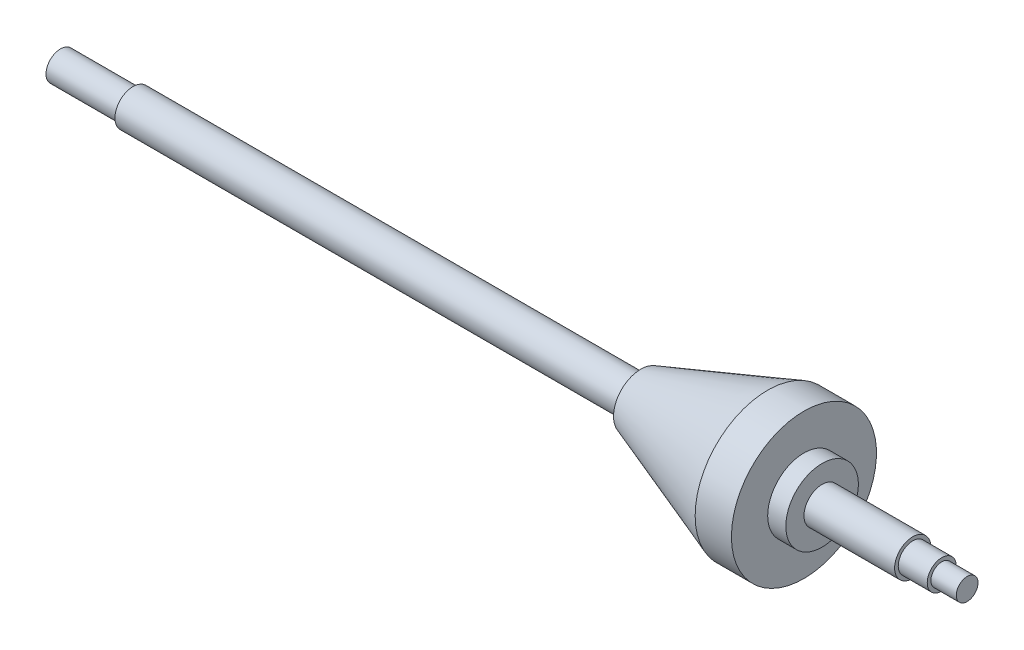
ISO-10303-21;
HEADER;
FILE_DESCRIPTION(('STEP AP214'),'2;1');
FILE_NAME('part.step','',(''),(''),'','','');
FILE_SCHEMA(('AUTOMOTIVE_DESIGN { 1 0 10303 214 1 1 1 1 }'));
ENDSEC;
DATA;
#1=APPLICATION_CONTEXT('core data for automotive mechanical design processes');
#2=APPLICATION_PROTOCOL_DEFINITION('international standard','automotive_design',2000,#1);
#3=PRODUCT_CONTEXT('',#1,'mechanical');
#4=PRODUCT('Part','Part','',(#3));
#5=PRODUCT_RELATED_PRODUCT_CATEGORY('part','',(#4));
#6=PRODUCT_DEFINITION_FORMATION('','',#4);
#7=PRODUCT_DEFINITION_CONTEXT('part definition',#1,'design');
#8=PRODUCT_DEFINITION('design','',#6,#7);
#9=PRODUCT_DEFINITION_SHAPE('','',#8);
#10=(LENGTH_UNIT() NAMED_UNIT(*) SI_UNIT(.MILLI.,.METRE.));
#11=(NAMED_UNIT(*) PLANE_ANGLE_UNIT() SI_UNIT($,.RADIAN.));
#12=(NAMED_UNIT(*) SI_UNIT($,.STERADIAN.) SOLID_ANGLE_UNIT());
#13=UNCERTAINTY_MEASURE_WITH_UNIT(LENGTH_MEASURE(1.E-05),#10,'distance_accuracy_value','');
#14=(GEOMETRIC_REPRESENTATION_CONTEXT(3) GLOBAL_UNCERTAINTY_ASSIGNED_CONTEXT((#13)) GLOBAL_UNIT_ASSIGNED_CONTEXT((#10,
#11,#12)) REPRESENTATION_CONTEXT('',''));
#15=CARTESIAN_POINT('',(0.,0.,0.));
#16=DIRECTION('',(0.,0.,1.));
#17=DIRECTION('',(1.,0.,0.));
#18=AXIS2_PLACEMENT_3D('',#15,#16,#17);
#19=CARTESIAN_POINT('',(-99.1470588235294,0.,0.));
#20=DIRECTION('',(1.,0.,0.));
#21=DIRECTION('',(0.,0.,-1.));
#22=AXIS2_PLACEMENT_3D('',#19,#20,#21);
#23=PLANE('',#22);
#24=CARTESIAN_POINT('',(-99.1470588235294,0.,0.));
#25=DIRECTION('',(-1.,0.,0.));
#26=DIRECTION('',(0.,0.,1.));
#27=AXIS2_PLACEMENT_3D('',#24,#25,#26);
#28=CIRCLE('',#27,4.);
#29=CARTESIAN_POINT('',(-99.1470588235294,0.,4.));
#30=VERTEX_POINT('',#29);
#31=EDGE_CURVE('E10',#30,#30,#28,.T.);
#32=ORIENTED_EDGE('',*,*,#31,.T.);
#33=EDGE_LOOP('',(#32));
#34=FACE_BOUND('',#33,.T.);
#35=ADVANCED_FACE('F31',(#34),#23,.F.);
#36=CARTESIAN_POINT('',(-132.617647058824,0.,0.));
#37=DIRECTION('',(-1.,0.,0.));
#38=DIRECTION('',(0.,0.,1.));
#39=AXIS2_PLACEMENT_3D('',#36,#37,#38);
#40=CYLINDRICAL_SURFACE('',#39,4.);
#41=ORIENTED_EDGE('',*,*,#31,.F.);
#42=EDGE_LOOP('',(#41));
#43=FACE_BOUND('',#42,.T.);
#44=CARTESIAN_POINT('',(-79.1470588235294,0.,0.));
#45=DIRECTION('',(-1.,0.,0.));
#46=DIRECTION('',(0.,0.,1.));
#47=AXIS2_PLACEMENT_3D('',#44,#45,#46);
#48=CIRCLE('',#47,4.);
#49=CARTESIAN_POINT('',(-79.1470588235294,0.,4.));
#50=VERTEX_POINT('',#49);
#51=EDGE_CURVE('E37',#50,#50,#48,.T.);
#52=ORIENTED_EDGE('',*,*,#51,.T.);
#53=EDGE_LOOP('',(#52));
#54=FACE_BOUND('',#53,.T.);
#55=ADVANCED_FACE('F96',(#43,#54),#40,.T.);
#56=CARTESIAN_POINT('',(-79.1470588235294,4.,0.));
#57=DIRECTION('',(1.,0.,0.));
#58=DIRECTION('',(0.,0.,-1.));
#59=AXIS2_PLACEMENT_3D('',#56,#57,#58);
#60=PLANE('',#59);
#61=ORIENTED_EDGE('',*,*,#51,.F.);
#62=EDGE_LOOP('',(#61));
#63=FACE_BOUND('',#62,.T.);
#64=CARTESIAN_POINT('',(-79.1470588235294,0.,0.));
#65=DIRECTION('',(-1.,0.,0.));
#66=DIRECTION('',(0.,0.,1.));
#67=AXIS2_PLACEMENT_3D('',#64,#65,#66);
#68=CIRCLE('',#67,5.);
#69=CARTESIAN_POINT('',(-79.1470588235294,0.,5.));
#70=VERTEX_POINT('',#69);
#71=EDGE_CURVE('E41',#70,#70,#68,.T.);
#72=ORIENTED_EDGE('',*,*,#71,.T.);
#73=EDGE_LOOP('',(#72));
#74=FACE_BOUND('',#73,.T.);
#75=ADVANCED_FACE('F100',(#63,#74),#60,.F.);
#76=CARTESIAN_POINT('',(-132.617647058824,0.,0.));
#77=DIRECTION('',(-1.,0.,0.));
#78=DIRECTION('',(0.,0.,1.));
#79=AXIS2_PLACEMENT_3D('',#76,#77,#78);
#80=CYLINDRICAL_SURFACE('',#79,5.);
#81=ORIENTED_EDGE('',*,*,#71,.F.);
#82=EDGE_LOOP('',(#81));
#83=FACE_BOUND('',#82,.T.);
#84=CARTESIAN_POINT('',(60.8529411764706,0.,0.));
#85=DIRECTION('',(-1.,0.,0.));
#86=DIRECTION('',(0.,0.,1.));
#87=AXIS2_PLACEMENT_3D('',#84,#85,#86);
#88=CIRCLE('',#87,5.);
#89=CARTESIAN_POINT('',(60.8529411764706,0.,5.));
#90=VERTEX_POINT('',#89);
#91=EDGE_CURVE('E45',#90,#90,#88,.T.);
#92=ORIENTED_EDGE('',*,*,#91,.T.);
#93=EDGE_LOOP('',(#92));
#94=FACE_BOUND('',#93,.T.);
#95=ADVANCED_FACE('F105',(#83,#94),#80,.T.);
#96=CARTESIAN_POINT('',(60.8529411764706,5.,0.));
#97=DIRECTION('',(1.,0.,0.));
#98=DIRECTION('',(0.,0.,-1.));
#99=AXIS2_PLACEMENT_3D('',#96,#97,#98);
#100=PLANE('',#99);
#101=ORIENTED_EDGE('',*,*,#91,.F.);
#102=EDGE_LOOP('',(#101));
#103=FACE_BOUND('',#102,.T.);
#104=CARTESIAN_POINT('',(60.8529411764706,0.,0.));
#105=DIRECTION('',(-1.,0.,0.));
#106=DIRECTION('',(0.,0.,1.));
#107=AXIS2_PLACEMENT_3D('',#104,#105,#106);
#108=CIRCLE('',#107,7.5);
#109=CARTESIAN_POINT('',(60.8529411764706,0.,7.5));
#110=VERTEX_POINT('',#109);
#111=EDGE_CURVE('E50',#110,#110,#108,.T.);
#112=ORIENTED_EDGE('',*,*,#111,.T.);
#113=EDGE_LOOP('',(#112));
#114=FACE_BOUND('',#113,.T.);
#115=ADVANCED_FACE('F111',(#103,#114),#100,.F.);
#116=CARTESIAN_POINT('',(95.8529411764706,0.,0.));
#117=DIRECTION('',(1.,0.,0.));
#118=DIRECTION('',(0.,0.,-1.));
#119=AXIS2_PLACEMENT_3D('',#116,#117,#118);
#120=CONICAL_SURFACE('',#119,20.,0.343023940420704);
#121=ORIENTED_EDGE('',*,*,#111,.F.);
#122=EDGE_LOOP('',(#121));
#123=FACE_BOUND('',#122,.T.);
#124=CARTESIAN_POINT('',(95.8529411764706,0.,0.));
#125=DIRECTION('',(-1.,0.,0.));
#126=DIRECTION('',(0.,0.,1.));
#127=AXIS2_PLACEMENT_3D('',#124,#125,#126);
#128=CIRCLE('',#127,20.);
#129=CARTESIAN_POINT('',(95.8529411764706,0.,20.));
#130=VERTEX_POINT('',#129);
#131=EDGE_CURVE('E53',#130,#130,#128,.T.);
#132=ORIENTED_EDGE('',*,*,#131,.T.);
#133=EDGE_LOOP('',(#132));
#134=FACE_BOUND('',#133,.T.);
#135=ADVANCED_FACE('F115',(#123,#134),#120,.T.);
#136=CARTESIAN_POINT('',(-132.617647058824,0.,0.));
#137=DIRECTION('',(-1.,0.,0.));
#138=DIRECTION('',(0.,0.,1.));
#139=AXIS2_PLACEMENT_3D('',#136,#137,#138);
#140=CYLINDRICAL_SURFACE('',#139,20.);
#141=ORIENTED_EDGE('',*,*,#131,.F.);
#142=EDGE_LOOP('',(#141));
#143=FACE_BOUND('',#142,.T.);
#144=CARTESIAN_POINT('',(105.852941176471,0.,0.));
#145=DIRECTION('',(-1.,0.,0.));
#146=DIRECTION('',(0.,0.,1.));
#147=AXIS2_PLACEMENT_3D('',#144,#145,#146);
#148=CIRCLE('',#147,20.);
#149=CARTESIAN_POINT('',(105.852941176471,0.,20.));
#150=VERTEX_POINT('',#149);
#151=EDGE_CURVE('E56',#150,#150,#148,.T.);
#152=ORIENTED_EDGE('',*,*,#151,.T.);
#153=EDGE_LOOP('',(#152));
#154=FACE_BOUND('',#153,.T.);
#155=ADVANCED_FACE('F119',(#143,#154),#140,.T.);
#156=CARTESIAN_POINT('',(105.852941176471,20.,0.));
#157=DIRECTION('',(-1.,0.,0.));
#158=DIRECTION('',(0.,0.,1.));
#159=AXIS2_PLACEMENT_3D('',#156,#157,#158);
#160=PLANE('',#159);
#161=ORIENTED_EDGE('',*,*,#151,.F.);
#162=EDGE_LOOP('',(#161));
#163=FACE_BOUND('',#162,.T.);
#164=CARTESIAN_POINT('',(105.852941176471,0.,0.));
#165=DIRECTION('',(-1.,0.,0.));
#166=DIRECTION('',(0.,0.,1.));
#167=AXIS2_PLACEMENT_3D('',#164,#165,#166);
#168=CIRCLE('',#167,10.);
#169=CARTESIAN_POINT('',(105.852941176471,0.,10.));
#170=VERTEX_POINT('',#169);
#171=EDGE_CURVE('E59',#170,#170,#168,.T.);
#172=ORIENTED_EDGE('',*,*,#171,.T.);
#173=EDGE_LOOP('',(#172));
#174=FACE_BOUND('',#173,.T.);
#175=ADVANCED_FACE('F123',(#163,#174),#160,.F.);
#176=CARTESIAN_POINT('',(-132.617647058824,0.,0.));
#177=DIRECTION('',(-1.,0.,0.));
#178=DIRECTION('',(0.,0.,1.));
#179=AXIS2_PLACEMENT_3D('',#176,#177,#178);
#180=CYLINDRICAL_SURFACE('',#179,10.);
#181=ORIENTED_EDGE('',*,*,#171,.F.);
#182=EDGE_LOOP('',(#181));
#183=FACE_BOUND('',#182,.T.);
#184=CARTESIAN_POINT('',(110.852941176471,0.,0.));
#185=DIRECTION('',(-1.,0.,0.));
#186=DIRECTION('',(0.,0.,1.));
#187=AXIS2_PLACEMENT_3D('',#184,#185,#186);
#188=CIRCLE('',#187,10.);
#189=CARTESIAN_POINT('',(110.852941176471,0.,10.));
#190=VERTEX_POINT('',#189);
#191=EDGE_CURVE('E62',#190,#190,#188,.T.);
#192=ORIENTED_EDGE('',*,*,#191,.T.);
#193=EDGE_LOOP('',(#192));
#194=FACE_BOUND('',#193,.T.);
#195=ADVANCED_FACE('F127',(#183,#194),#180,.T.);
#196=CARTESIAN_POINT('',(110.852941176471,10.,0.));
#197=DIRECTION('',(-1.,0.,0.));
#198=DIRECTION('',(0.,0.,1.));
#199=AXIS2_PLACEMENT_3D('',#196,#197,#198);
#200=PLANE('',#199);
#201=ORIENTED_EDGE('',*,*,#191,.F.);
#202=EDGE_LOOP('',(#201));
#203=FACE_BOUND('',#202,.T.);
#204=CARTESIAN_POINT('',(110.852941176471,0.,0.));
#205=DIRECTION('',(-1.,0.,0.));
#206=DIRECTION('',(0.,0.,1.));
#207=AXIS2_PLACEMENT_3D('',#204,#205,#206);
#208=CIRCLE('',#207,5.);
#209=CARTESIAN_POINT('',(110.852941176471,0.,5.));
#210=VERTEX_POINT('',#209);
#211=EDGE_CURVE('E65',#210,#210,#208,.T.);
#212=ORIENTED_EDGE('',*,*,#211,.T.);
#213=EDGE_LOOP('',(#212));
#214=FACE_BOUND('',#213,.T.);
#215=ADVANCED_FACE('F131',(#203,#214),#200,.F.);
#216=CARTESIAN_POINT('',(-132.617647058824,0.,0.));
#217=DIRECTION('',(-1.,0.,0.));
#218=DIRECTION('',(0.,0.,1.));
#219=AXIS2_PLACEMENT_3D('',#216,#217,#218);
#220=CYLINDRICAL_SURFACE('',#219,5.);
#221=ORIENTED_EDGE('',*,*,#211,.F.);
#222=EDGE_LOOP('',(#221));
#223=FACE_BOUND('',#222,.T.);
#224=CARTESIAN_POINT('',(135.852941176471,0.,0.));
#225=DIRECTION('',(-1.,0.,0.));
#226=DIRECTION('',(0.,0.,1.));
#227=AXIS2_PLACEMENT_3D('',#224,#225,#226);
#228=CIRCLE('',#227,5.);
#229=CARTESIAN_POINT('',(135.852941176471,0.,5.));
#230=VERTEX_POINT('',#229);
#231=EDGE_CURVE('E68',#230,#230,#228,.T.);
#232=ORIENTED_EDGE('',*,*,#231,.T.);
#233=EDGE_LOOP('',(#232));
#234=FACE_BOUND('',#233,.T.);
#235=ADVANCED_FACE('F135',(#223,#234),#220,.T.);
#236=CARTESIAN_POINT('',(135.852941176471,5.,0.));
#237=DIRECTION('',(-1.,0.,0.));
#238=DIRECTION('',(0.,0.,1.));
#239=AXIS2_PLACEMENT_3D('',#236,#237,#238);
#240=PLANE('',#239);
#241=ORIENTED_EDGE('',*,*,#231,.F.);
#242=EDGE_LOOP('',(#241));
#243=FACE_BOUND('',#242,.T.);
#244=CARTESIAN_POINT('',(135.852941176471,0.,0.));
#245=DIRECTION('',(-1.,0.,0.));
#246=DIRECTION('',(0.,0.,1.));
#247=AXIS2_PLACEMENT_3D('',#244,#245,#246);
#248=CIRCLE('',#247,4.);
#249=CARTESIAN_POINT('',(135.852941176471,0.,4.));
#250=VERTEX_POINT('',#249);
#251=EDGE_CURVE('E71',#250,#250,#248,.T.);
#252=ORIENTED_EDGE('',*,*,#251,.T.);
#253=EDGE_LOOP('',(#252));
#254=FACE_BOUND('',#253,.T.);
#255=ADVANCED_FACE('F139',(#243,#254),#240,.F.);
#256=CARTESIAN_POINT('',(-132.617647058824,0.,0.));
#257=DIRECTION('',(-1.,0.,0.));
#258=DIRECTION('',(0.,0.,1.));
#259=AXIS2_PLACEMENT_3D('',#256,#257,#258);
#260=CYLINDRICAL_SURFACE('',#259,4.);
#261=ORIENTED_EDGE('',*,*,#251,.F.);
#262=EDGE_LOOP('',(#261));
#263=FACE_BOUND('',#262,.T.);
#264=CARTESIAN_POINT('',(143.852941176471,0.,0.));
#265=DIRECTION('',(-1.,0.,0.));
#266=DIRECTION('',(0.,0.,1.));
#267=AXIS2_PLACEMENT_3D('',#264,#265,#266);
#268=CIRCLE('',#267,4.);
#269=CARTESIAN_POINT('',(143.852941176471,0.,4.));
#270=VERTEX_POINT('',#269);
#271=EDGE_CURVE('E74',#270,#270,#268,.T.);
#272=ORIENTED_EDGE('',*,*,#271,.T.);
#273=EDGE_LOOP('',(#272));
#274=FACE_BOUND('',#273,.T.);
#275=ADVANCED_FACE('F143',(#263,#274),#260,.T.);
#276=CARTESIAN_POINT('',(143.852941176471,4.,0.));
#277=DIRECTION('',(-1.,0.,0.));
#278=DIRECTION('',(0.,0.,1.));
#279=AXIS2_PLACEMENT_3D('',#276,#277,#278);
#280=PLANE('',#279);
#281=ORIENTED_EDGE('',*,*,#271,.F.);
#282=EDGE_LOOP('',(#281));
#283=FACE_BOUND('',#282,.T.);
#284=CARTESIAN_POINT('',(143.852941176471,0.,0.));
#285=DIRECTION('',(-1.,0.,0.));
#286=DIRECTION('',(0.,0.,1.));
#287=AXIS2_PLACEMENT_3D('',#284,#285,#286);
#288=CIRCLE('',#287,3.);
#289=CARTESIAN_POINT('',(143.852941176471,0.,3.));
#290=VERTEX_POINT('',#289);
#291=EDGE_CURVE('E77',#290,#290,#288,.T.);
#292=ORIENTED_EDGE('',*,*,#291,.T.);
#293=EDGE_LOOP('',(#292));
#294=FACE_BOUND('',#293,.T.);
#295=ADVANCED_FACE('F92',(#283,#294),#280,.F.);
#296=CARTESIAN_POINT('',(-132.617647058824,0.,0.));
#297=DIRECTION('',(-1.,0.,0.));
#298=DIRECTION('',(0.,0.,1.));
#299=AXIS2_PLACEMENT_3D('',#296,#297,#298);
#300=CYLINDRICAL_SURFACE('',#299,3.);
#301=ORIENTED_EDGE('',*,*,#291,.F.);
#302=EDGE_LOOP('',(#301));
#303=FACE_BOUND('',#302,.T.);
#304=CARTESIAN_POINT('',(150.852941176471,0.,0.));
#305=DIRECTION('',(-1.,0.,0.));
#306=DIRECTION('',(0.,0.,1.));
#307=AXIS2_PLACEMENT_3D('',#304,#305,#306);
#308=CIRCLE('',#307,3.);
#309=CARTESIAN_POINT('',(150.852941176471,0.,3.));
#310=VERTEX_POINT('',#309);
#311=EDGE_CURVE('E80',#310,#310,#308,.T.);
#312=ORIENTED_EDGE('',*,*,#311,.T.);
#313=EDGE_LOOP('',(#312));
#314=FACE_BOUND('',#313,.T.);
#315=ADVANCED_FACE('F84',(#303,#314),#300,.T.);
#316=CARTESIAN_POINT('',(150.852941176471,3.,0.));
#317=DIRECTION('',(-1.,0.,0.));
#318=DIRECTION('',(0.,0.,1.));
#319=AXIS2_PLACEMENT_3D('',#316,#317,#318);
#320=PLANE('',#319);
#321=ORIENTED_EDGE('',*,*,#311,.F.);
#322=EDGE_LOOP('',(#321));
#323=FACE_BOUND('',#322,.T.);
#324=ADVANCED_FACE('F86',(#323),#320,.F.);
#325=CLOSED_SHELL('',(#35,#55,#75,#95,#115,#135,#155,#175,#195,#215,#235,#255,#275,#295,#315,#324));
#326=MANIFOLD_SOLID_BREP('B2',#325);
#327=ADVANCED_BREP_SHAPE_REPRESENTATION('',(#18,#326),#14);
#328=SHAPE_DEFINITION_REPRESENTATION(#9,#327);
ENDSEC;
END-ISO-10303-21;
